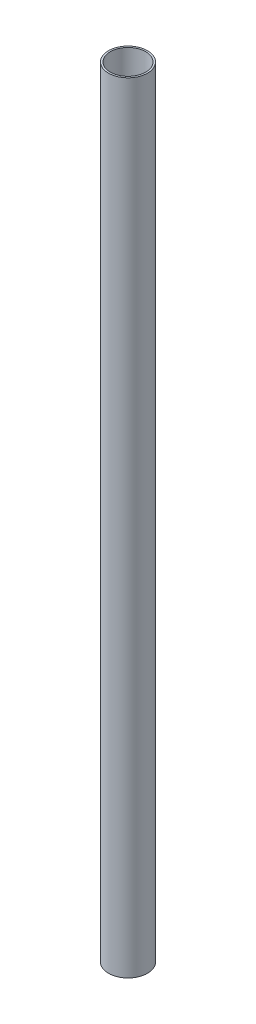
ISO-10303-21;
HEADER;
FILE_DESCRIPTION(('STEP AP214'),'2;1');
FILE_NAME('part.step','',(''),(''),'','','');
FILE_SCHEMA(('AUTOMOTIVE_DESIGN { 1 0 10303 214 1 1 1 1 }'));
ENDSEC;
DATA;
#1=APPLICATION_CONTEXT('core data for automotive mechanical design processes');
#2=APPLICATION_PROTOCOL_DEFINITION('international standard','automotive_design',2000,#1);
#3=PRODUCT_CONTEXT('',#1,'mechanical');
#4=PRODUCT('Part','Part','',(#3));
#5=PRODUCT_RELATED_PRODUCT_CATEGORY('part','',(#4));
#6=PRODUCT_DEFINITION_FORMATION('','',#4);
#7=PRODUCT_DEFINITION_CONTEXT('part definition',#1,'design');
#8=PRODUCT_DEFINITION('design','',#6,#7);
#9=PRODUCT_DEFINITION_SHAPE('','',#8);
#10=(LENGTH_UNIT() NAMED_UNIT(*) SI_UNIT(.MILLI.,.METRE.));
#11=(NAMED_UNIT(*) PLANE_ANGLE_UNIT() SI_UNIT($,.RADIAN.));
#12=(NAMED_UNIT(*) SI_UNIT($,.STERADIAN.) SOLID_ANGLE_UNIT());
#13=UNCERTAINTY_MEASURE_WITH_UNIT(LENGTH_MEASURE(1.E-05),#10,'distance_accuracy_value','');
#14=(GEOMETRIC_REPRESENTATION_CONTEXT(3) GLOBAL_UNCERTAINTY_ASSIGNED_CONTEXT((#13)) GLOBAL_UNIT_ASSIGNED_CONTEXT((#10,
#11,#12)) REPRESENTATION_CONTEXT('',''));
#15=CARTESIAN_POINT('',(0.,0.,0.));
#16=DIRECTION('',(0.,0.,1.));
#17=DIRECTION('',(1.,0.,0.));
#18=AXIS2_PLACEMENT_3D('',#15,#16,#17);
#19=CARTESIAN_POINT('',(0.,220.,0.));
#20=DIRECTION('',(0.,1.,0.));
#21=DIRECTION('',(0.,0.,1.));
#22=AXIS2_PLACEMENT_3D('',#19,#20,#21);
#23=PLANE('',#22);
#24=CARTESIAN_POINT('',(0.,220.,0.));
#25=DIRECTION('',(0.,1.,0.));
#26=DIRECTION('',(0.,0.,1.));
#27=AXIS2_PLACEMENT_3D('',#24,#25,#26);
#28=CIRCLE('',#27,11.);
#29=CARTESIAN_POINT('',(0.,220.,11.));
#30=VERTEX_POINT('',#29);
#31=EDGE_CURVE('E10',#30,#30,#28,.T.);
#32=ORIENTED_EDGE('',*,*,#31,.T.);
#33=EDGE_LOOP('',(#32));
#34=FACE_BOUND('',#33,.T.);
#35=CARTESIAN_POINT('',(0.,220.,0.));
#36=DIRECTION('',(0.,1.,0.));
#37=DIRECTION('',(0.,0.,1.));
#38=AXIS2_PLACEMENT_3D('',#35,#36,#37);
#39=CIRCLE('',#38,10.);
#40=CARTESIAN_POINT('',(0.,220.,10.));
#41=VERTEX_POINT('',#40);
#42=EDGE_CURVE('E43',#41,#41,#39,.T.);
#43=ORIENTED_EDGE('',*,*,#42,.F.);
#44=EDGE_LOOP('',(#43));
#45=FACE_BOUND('',#44,.T.);
#46=ADVANCED_FACE('F32',(#34,#45),#23,.T.);
#47=CARTESIAN_POINT('',(0.,-220.,0.));
#48=DIRECTION('',(0.,1.,0.));
#49=DIRECTION('',(0.,0.,1.));
#50=AXIS2_PLACEMENT_3D('',#47,#48,#49);
#51=PLANE('',#50);
#52=CARTESIAN_POINT('',(0.,-220.,0.));
#53=DIRECTION('',(0.,1.,0.));
#54=DIRECTION('',(0.,0.,1.));
#55=AXIS2_PLACEMENT_3D('',#52,#53,#54);
#56=CIRCLE('',#55,11.);
#57=CARTESIAN_POINT('',(0.,-220.,11.));
#58=VERTEX_POINT('',#57);
#59=EDGE_CURVE('E36',#58,#58,#56,.T.);
#60=ORIENTED_EDGE('',*,*,#59,.F.);
#61=EDGE_LOOP('',(#60));
#62=FACE_BOUND('',#61,.T.);
#63=CARTESIAN_POINT('',(0.,-220.,0.));
#64=DIRECTION('',(0.,1.,0.));
#65=DIRECTION('',(0.,0.,1.));
#66=AXIS2_PLACEMENT_3D('',#63,#64,#65);
#67=CIRCLE('',#66,10.);
#68=CARTESIAN_POINT('',(0.,-220.,10.));
#69=VERTEX_POINT('',#68);
#70=EDGE_CURVE('E45',#69,#69,#67,.T.);
#71=ORIENTED_EDGE('',*,*,#70,.T.);
#72=EDGE_LOOP('',(#71));
#73=FACE_BOUND('',#72,.T.);
#74=ADVANCED_FACE('F55',(#62,#73),#51,.F.);
#75=CARTESIAN_POINT('',(0.,220.,0.));
#76=DIRECTION('',(0.,-1.,0.));
#77=DIRECTION('',(0.,0.,-1.));
#78=AXIS2_PLACEMENT_3D('',#75,#76,#77);
#79=CYLINDRICAL_SURFACE('',#78,11.);
#80=ORIENTED_EDGE('',*,*,#31,.F.);
#81=EDGE_LOOP('',(#80));
#82=FACE_BOUND('',#81,.T.);
#83=ORIENTED_EDGE('',*,*,#59,.T.);
#84=EDGE_LOOP('',(#83));
#85=FACE_BOUND('',#84,.T.);
#86=ADVANCED_FACE('F34',(#82,#85),#79,.T.);
#87=CARTESIAN_POINT('',(0.,220.,0.));
#88=DIRECTION('',(0.,-1.,0.));
#89=DIRECTION('',(0.,0.,-1.));
#90=AXIS2_PLACEMENT_3D('',#87,#88,#89);
#91=CYLINDRICAL_SURFACE('',#90,10.);
#92=ORIENTED_EDGE('',*,*,#42,.T.);
#93=EDGE_LOOP('',(#92));
#94=FACE_BOUND('',#93,.T.);
#95=ORIENTED_EDGE('',*,*,#70,.F.);
#96=EDGE_LOOP('',(#95));
#97=FACE_BOUND('',#96,.T.);
#98=ADVANCED_FACE('F51',(#94,#97),#91,.F.);
#99=CLOSED_SHELL('',(#46,#74,#86,#98));
#100=MANIFOLD_SOLID_BREP('B2',#99);
#101=ADVANCED_BREP_SHAPE_REPRESENTATION('',(#18,#100),#14);
#102=SHAPE_DEFINITION_REPRESENTATION(#9,#101);
ENDSEC;
END-ISO-10303-21;
